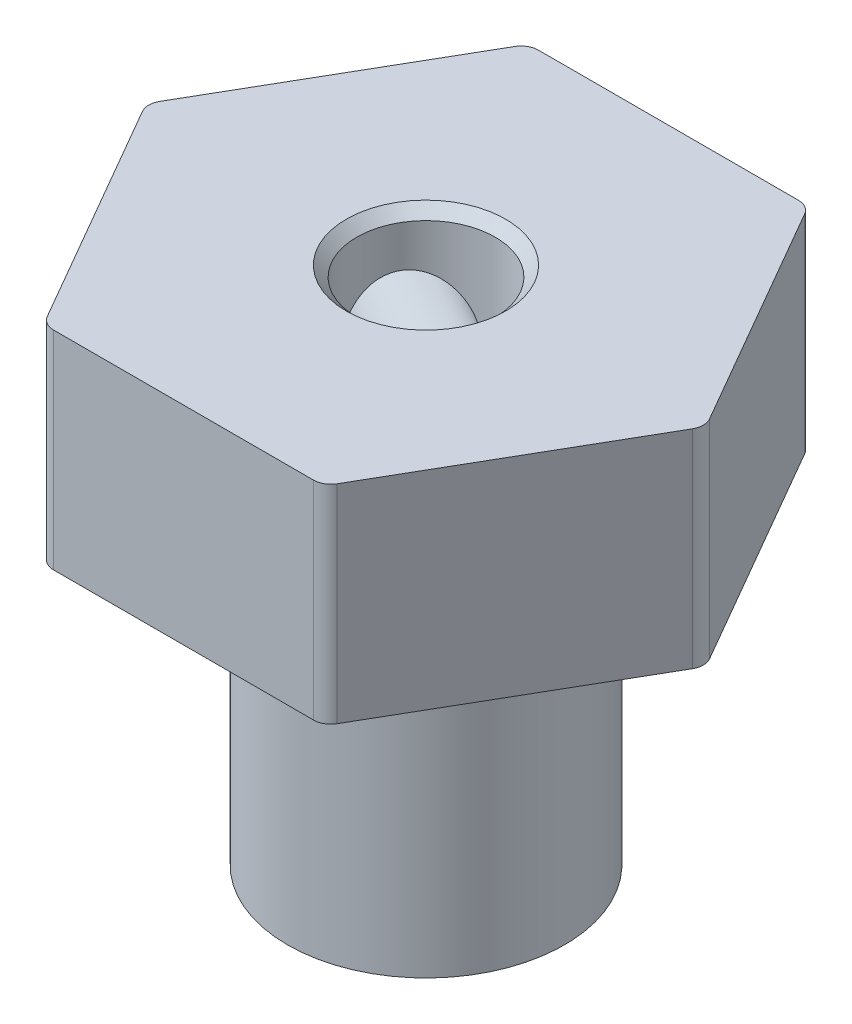
ISO-10303-21;
HEADER;
FILE_DESCRIPTION(('STEP AP214'),'2;1');
FILE_NAME('part.step','',(''),(''),'','','');
FILE_SCHEMA(('AUTOMOTIVE_DESIGN { 1 0 10303 214 1 1 1 1 }'));
ENDSEC;
DATA;
#1=APPLICATION_CONTEXT('core data for automotive mechanical design processes');
#2=APPLICATION_PROTOCOL_DEFINITION('international standard','automotive_design',2000,#1);
#3=PRODUCT_CONTEXT('',#1,'mechanical');
#4=PRODUCT('Part','Part','',(#3));
#5=PRODUCT_RELATED_PRODUCT_CATEGORY('part','',(#4));
#6=PRODUCT_DEFINITION_FORMATION('','',#4);
#7=PRODUCT_DEFINITION_CONTEXT('part definition',#1,'design');
#8=PRODUCT_DEFINITION('design','',#6,#7);
#9=PRODUCT_DEFINITION_SHAPE('','',#8);
#10=(LENGTH_UNIT() NAMED_UNIT(*) SI_UNIT(.MILLI.,.METRE.));
#11=(NAMED_UNIT(*) PLANE_ANGLE_UNIT() SI_UNIT($,.RADIAN.));
#12=(NAMED_UNIT(*) SI_UNIT($,.STERADIAN.) SOLID_ANGLE_UNIT());
#13=UNCERTAINTY_MEASURE_WITH_UNIT(LENGTH_MEASURE(1.E-05),#10,'distance_accuracy_value','');
#14=(GEOMETRIC_REPRESENTATION_CONTEXT(3) GLOBAL_UNCERTAINTY_ASSIGNED_CONTEXT((#13)) GLOBAL_UNIT_ASSIGNED_CONTEXT((#10,
#11,#12)) REPRESENTATION_CONTEXT('',''));
#15=CARTESIAN_POINT('',(0.,0.,0.));
#16=DIRECTION('',(0.,0.,1.));
#17=DIRECTION('',(1.,0.,0.));
#18=AXIS2_PLACEMENT_3D('',#15,#16,#17);
#19=CARTESIAN_POINT('',(4.04145188432745,6.,6.99999999999993));
#20=DIRECTION('',(-0.866025403784441,0.,-0.499999999999995));
#21=DIRECTION('',(-0.499999999999995,0.,0.866025403784441));
#22=AXIS2_PLACEMENT_3D('',#19,#20,#21);
#23=PLANE('',#22);
#24=DIRECTION('',(0.499999999999995,0.,-0.866025403784441));
#25=VECTOR('',#24,1.);
#26=CARTESIAN_POINT('',(4.04145188432745,0.,6.99999999999993));
#27=LINE('',#26,#25);
#28=CARTESIAN_POINT('',(4.18578945162485,0.,6.74999999999993));
#29=VERTEX_POINT('',#28);
#30=CARTESIAN_POINT('',(7.93856620135733,0.,0.249999999999999));
#31=VERTEX_POINT('',#30);
#32=EDGE_CURVE('E272',#29,#31,#27,.T.);
#33=ORIENTED_EDGE('',*,*,#32,.T.);
#34=DIRECTION('',(0.,-1.,0.));
#35=VECTOR('',#34,1.);
#36=CARTESIAN_POINT('',(7.93856620135733,6.,0.249999999999999));
#37=LINE('',#36,#35);
#38=CARTESIAN_POINT('',(7.93856620135733,6.,0.249999999999999));
#39=VERTEX_POINT('',#38);
#40=EDGE_CURVE('E240',#31,#39,#37,.F.);
#41=ORIENTED_EDGE('',*,*,#40,.T.);
#42=DIRECTION('',(0.499999999999995,0.,-0.866025403784441));
#43=VECTOR('',#42,1.);
#44=CARTESIAN_POINT('',(4.04145188432745,6.,6.99999999999993));
#45=LINE('',#44,#43);
#46=CARTESIAN_POINT('',(4.18578945162485,6.,6.74999999999993));
#47=VERTEX_POINT('',#46);
#48=EDGE_CURVE('E167',#47,#39,#45,.T.);
#49=ORIENTED_EDGE('',*,*,#48,.F.);
#50=DIRECTION('',(0.,-1.,0.));
#51=VECTOR('',#50,1.);
#52=CARTESIAN_POINT('',(4.18578945162485,6.,6.74999999999993));
#53=LINE('',#52,#51);
#54=EDGE_CURVE('E236',#47,#29,#53,.T.);
#55=ORIENTED_EDGE('',*,*,#54,.T.);
#56=EDGE_LOOP('',(#33,#41,#49,#55));
#57=FACE_BOUND('',#56,.T.);
#58=ADVANCED_FACE('F40',(#57),#23,.F.);
#59=CARTESIAN_POINT('',(8.08290376865473,6.,0.));
#60=DIRECTION('',(-0.866025403784438,0.,0.500000000000001));
#61=DIRECTION('',(0.500000000000001,0.,0.866025403784438));
#62=AXIS2_PLACEMENT_3D('',#59,#60,#61);
#63=PLANE('',#62);
#64=DIRECTION('',(-0.500000000000001,0.,-0.866025403784438));
#65=VECTOR('',#64,1.);
#66=CARTESIAN_POINT('',(8.08290376865473,0.,0.));
#67=LINE('',#66,#65);
#68=CARTESIAN_POINT('',(7.93856620135733,0.,-0.249999999999999));
#69=VERTEX_POINT('',#68);
#70=CARTESIAN_POINT('',(4.18578945162476,0.,-6.74999999999999));
#71=VERTEX_POINT('',#70);
#72=EDGE_CURVE('E276',#69,#71,#67,.T.);
#73=ORIENTED_EDGE('',*,*,#72,.T.);
#74=DIRECTION('',(0.,-1.,0.));
#75=VECTOR('',#74,1.);
#76=CARTESIAN_POINT('',(4.18578945162476,6.,-6.74999999999998));
#77=LINE('',#76,#75);
#78=CARTESIAN_POINT('',(4.18578945162476,6.,-6.74999999999999));
#79=VERTEX_POINT('',#78);
#80=EDGE_CURVE('E233',#71,#79,#77,.F.);
#81=ORIENTED_EDGE('',*,*,#80,.T.);
#82=DIRECTION('',(-0.500000000000001,0.,-0.866025403784438));
#83=VECTOR('',#82,1.);
#84=CARTESIAN_POINT('',(8.08290376865473,6.,0.));
#85=LINE('',#84,#83);
#86=CARTESIAN_POINT('',(7.93856620135733,6.,-0.249999999999999));
#87=VERTEX_POINT('',#86);
#88=EDGE_CURVE('E173',#87,#79,#85,.T.);
#89=ORIENTED_EDGE('',*,*,#88,.F.);
#90=DIRECTION('',(0.,-1.,0.));
#91=VECTOR('',#90,1.);
#92=CARTESIAN_POINT('',(7.93856620135733,6.,-0.249999999999999));
#93=LINE('',#92,#91);
#94=EDGE_CURVE('E229',#87,#69,#93,.T.);
#95=ORIENTED_EDGE('',*,*,#94,.T.);
#96=EDGE_LOOP('',(#73,#81,#89,#95));
#97=FACE_BOUND('',#96,.T.);
#98=ADVANCED_FACE('F306',(#97),#63,.F.);
#99=CARTESIAN_POINT('',(4.04145188432735,6.,-6.99999999999998));
#100=DIRECTION('',(0.,0.,1.));
#101=DIRECTION('',(1.,0.,0.));
#102=AXIS2_PLACEMENT_3D('',#99,#100,#101);
#103=PLANE('',#102);
#104=DIRECTION('',(-1.,0.,0.));
#105=VECTOR('',#104,1.);
#106=CARTESIAN_POINT('',(4.04145188432735,0.,-6.99999999999998));
#107=LINE('',#106,#105);
#108=CARTESIAN_POINT('',(3.75277674973254,0.,-6.99999999999998));
#109=VERTEX_POINT('',#108);
#110=CARTESIAN_POINT('',(-3.75277674973258,0.,-6.99999999999996));
#111=VERTEX_POINT('',#110);
#112=EDGE_CURVE('E280',#109,#111,#107,.T.);
#113=ORIENTED_EDGE('',*,*,#112,.T.);
#114=DIRECTION('',(0.,-1.,0.));
#115=VECTOR('',#114,1.);
#116=CARTESIAN_POINT('',(-3.75277674973258,6.,-6.99999999999996));
#117=LINE('',#116,#115);
#118=CARTESIAN_POINT('',(-3.75277674973258,6.,-6.99999999999996));
#119=VERTEX_POINT('',#118);
#120=EDGE_CURVE('E226',#111,#119,#117,.F.);
#121=ORIENTED_EDGE('',*,*,#120,.T.);
#122=DIRECTION('',(-1.,0.,0.));
#123=VECTOR('',#122,1.);
#124=CARTESIAN_POINT('',(4.04145188432735,6.,-6.99999999999998));
#125=LINE('',#124,#123);
#126=CARTESIAN_POINT('',(3.75277674973254,6.,-6.99999999999998));
#127=VERTEX_POINT('',#126);
#128=EDGE_CURVE('E260',#127,#119,#125,.T.);
#129=ORIENTED_EDGE('',*,*,#128,.F.);
#130=DIRECTION('',(0.,-1.,0.));
#131=VECTOR('',#130,1.);
#132=CARTESIAN_POINT('',(3.75277674973254,6.,-6.99999999999998));
#133=LINE('',#132,#131);
#134=EDGE_CURVE('E222',#127,#109,#133,.T.);
#135=ORIENTED_EDGE('',*,*,#134,.T.);
#136=EDGE_LOOP('',(#113,#121,#129,#135));
#137=FACE_BOUND('',#136,.T.);
#138=ADVANCED_FACE('F302',(#137),#103,.F.);
#139=CARTESIAN_POINT('',(-4.0414518843274,6.,-6.99999999999995));
#140=DIRECTION('',(0.866025403784441,0.,0.499999999999995));
#141=DIRECTION('',(0.499999999999995,0.,-0.866025403784441));
#142=AXIS2_PLACEMENT_3D('',#139,#140,#141);
#143=PLANE('',#142);
#144=CARTESIAN_POINT('',(-6.06217782649107,3.,-3.49999999999995));
#145=DIRECTION('',(-0.866025403784442,0.,-0.499999999999995));
#146=DIRECTION('',(-0.499999999999995,0.,0.866025403784442));
#147=AXIS2_PLACEMENT_3D('',#144,#145,#146);
#148=CIRCLE('',#147,1.5);
#149=CARTESIAN_POINT('',(-6.81217782649106,3.,-2.20096189432329));
#150=VERTEX_POINT('',#149);
#151=EDGE_CURVE('E422',#150,#150,#148,.T.);
#152=ORIENTED_EDGE('',*,*,#151,.F.);
#153=EDGE_LOOP('',(#152));
#154=FACE_BOUND('',#153,.T.);
#155=DIRECTION('',(-0.499999999999995,0.,0.866025403784441));
#156=VECTOR('',#155,1.);
#157=CARTESIAN_POINT('',(-4.0414518843274,0.,-6.99999999999995));
#158=LINE('',#157,#156);
#159=CARTESIAN_POINT('',(-4.1857894516248,0.,-6.74999999999995));
#160=VERTEX_POINT('',#159);
#161=CARTESIAN_POINT('',(-7.93856620135733,0.,-0.249999999999944));
#162=VERTEX_POINT('',#161);
#163=EDGE_CURVE('E175',#160,#162,#158,.T.);
#164=ORIENTED_EDGE('',*,*,#163,.T.);
#165=DIRECTION('',(0.,-1.,0.));
#166=VECTOR('',#165,1.);
#167=CARTESIAN_POINT('',(-7.93856620135733,6.,-0.249999999999945));
#168=LINE('',#167,#166);
#169=CARTESIAN_POINT('',(-7.93856620135733,6.,-0.249999999999944));
#170=VERTEX_POINT('',#169);
#171=EDGE_CURVE('E62',#162,#170,#168,.F.);
#172=ORIENTED_EDGE('',*,*,#171,.T.);
#173=DIRECTION('',(-0.499999999999995,0.,0.866025403784441));
#174=VECTOR('',#173,1.);
#175=CARTESIAN_POINT('',(-4.0414518843274,6.,-6.99999999999995));
#176=LINE('',#175,#174);
#177=CARTESIAN_POINT('',(-4.1857894516248,6.,-6.74999999999995));
#178=VERTEX_POINT('',#177);
#179=EDGE_CURVE('E263',#178,#170,#176,.T.);
#180=ORIENTED_EDGE('',*,*,#179,.F.);
#181=DIRECTION('',(0.,-1.,0.));
#182=VECTOR('',#181,1.);
#183=CARTESIAN_POINT('',(-4.1857894516248,6.,-6.74999999999995));
#184=LINE('',#183,#182);
#185=EDGE_CURVE('E216',#178,#160,#184,.T.);
#186=ORIENTED_EDGE('',*,*,#185,.T.);
#187=EDGE_LOOP('',(#164,#172,#180,#186));
#188=FACE_BOUND('',#187,.T.);
#189=ADVANCED_FACE('F285',(#154,#188),#143,.F.);
#190=CARTESIAN_POINT('',(-8.08290376865473,6.,0.));
#191=DIRECTION('',(0.866025403784434,0.,-0.500000000000007));
#192=DIRECTION('',(-0.500000000000007,0.,-0.866025403784435));
#193=AXIS2_PLACEMENT_3D('',#190,#191,#192);
#194=PLANE('',#193);
#195=DIRECTION('',(0.500000000000007,0.,0.866025403784435));
#196=VECTOR('',#195,1.);
#197=CARTESIAN_POINT('',(-8.08290376865473,0.,0.));
#198=LINE('',#197,#196);
#199=CARTESIAN_POINT('',(-7.93856620135732,0.,0.250000000000056));
#200=VERTEX_POINT('',#199);
#201=CARTESIAN_POINT('',(-4.18578945162471,0.,6.75000000000002));
#202=VERTEX_POINT('',#201);
#203=EDGE_CURVE('E168',#200,#202,#198,.T.);
#204=ORIENTED_EDGE('',*,*,#203,.T.);
#205=DIRECTION('',(0.,-1.,0.));
#206=VECTOR('',#205,1.);
#207=CARTESIAN_POINT('',(-4.18578945162471,6.,6.75000000000001));
#208=LINE('',#207,#206);
#209=CARTESIAN_POINT('',(-4.18578945162471,6.,6.75000000000002));
#210=VERTEX_POINT('',#209);
#211=EDGE_CURVE('E143',#202,#210,#208,.F.);
#212=ORIENTED_EDGE('',*,*,#211,.T.);
#213=DIRECTION('',(0.500000000000007,0.,0.866025403784435));
#214=VECTOR('',#213,1.);
#215=CARTESIAN_POINT('',(-8.08290376865473,6.,0.));
#216=LINE('',#215,#214);
#217=CARTESIAN_POINT('',(-7.93856620135732,6.,0.250000000000056));
#218=VERTEX_POINT('',#217);
#219=EDGE_CURVE('E266',#218,#210,#216,.T.);
#220=ORIENTED_EDGE('',*,*,#219,.F.);
#221=DIRECTION('',(0.,-1.,0.));
#222=VECTOR('',#221,1.);
#223=CARTESIAN_POINT('',(-7.93856620135732,6.,0.250000000000056));
#224=LINE('',#223,#222);
#225=EDGE_CURVE('E149',#218,#200,#224,.T.);
#226=ORIENTED_EDGE('',*,*,#225,.T.);
#227=EDGE_LOOP('',(#204,#212,#220,#226));
#228=FACE_BOUND('',#227,.T.);
#229=ADVANCED_FACE('F294',(#228),#194,.F.);
#230=CARTESIAN_POINT('',(-4.0414518843273,6.,7.00000000000001));
#231=DIRECTION('',(0.,0.,-1.));
#232=DIRECTION('',(-1.,0.,0.));
#233=AXIS2_PLACEMENT_3D('',#230,#231,#232);
#234=PLANE('',#233);
#235=DIRECTION('',(1.,0.,0.));
#236=VECTOR('',#235,1.);
#237=CARTESIAN_POINT('',(-4.0414518843273,6.,7.00000000000001));
#238=LINE('',#237,#236);
#239=CARTESIAN_POINT('',(-3.75277674973249,6.,7.00000000000001));
#240=VERTEX_POINT('',#239);
#241=CARTESIAN_POINT('',(3.75277674973264,6.,6.99999999999993));
#242=VERTEX_POINT('',#241);
#243=EDGE_CURVE('E159',#240,#242,#238,.T.);
#244=ORIENTED_EDGE('',*,*,#243,.F.);
#245=DIRECTION('',(0.,-1.,0.));
#246=VECTOR('',#245,1.);
#247=CARTESIAN_POINT('',(-3.75277674973249,6.,7.00000000000001));
#248=LINE('',#247,#246);
#249=CARTESIAN_POINT('',(-3.75277674973249,0.,7.00000000000001));
#250=VERTEX_POINT('',#249);
#251=EDGE_CURVE('E142',#240,#250,#248,.T.);
#252=ORIENTED_EDGE('',*,*,#251,.T.);
#253=DIRECTION('',(1.,0.,0.));
#254=VECTOR('',#253,1.);
#255=CARTESIAN_POINT('',(-4.0414518843273,0.,7.00000000000001));
#256=LINE('',#255,#254);
#257=CARTESIAN_POINT('',(3.75277674973264,0.,6.99999999999993));
#258=VERTEX_POINT('',#257);
#259=EDGE_CURVE('E156',#250,#258,#256,.T.);
#260=ORIENTED_EDGE('',*,*,#259,.T.);
#261=DIRECTION('',(0.,-1.,0.));
#262=VECTOR('',#261,1.);
#263=CARTESIAN_POINT('',(3.75277674973264,6.,6.99999999999993));
#264=LINE('',#263,#262);
#265=EDGE_CURVE('E162',#258,#242,#264,.F.);
#266=ORIENTED_EDGE('',*,*,#265,.T.);
#267=EDGE_LOOP('',(#244,#252,#260,#266));
#268=FACE_BOUND('',#267,.T.);
#269=ADVANCED_FACE('F155',(#268),#234,.F.);
#270=CARTESIAN_POINT('',(0.,6.,0.));
#271=DIRECTION('',(0.,1.,0.));
#272=DIRECTION('',(0.,0.,1.));
#273=AXIS2_PLACEMENT_3D('',#270,#271,#272);
#274=PLANE('',#273);
#275=CARTESIAN_POINT('',(0.,6.,0.));
#276=DIRECTION('',(0.,1.,0.));
#277=DIRECTION('',(0.,0.,1.));
#278=AXIS2_PLACEMENT_3D('',#275,#276,#277);
#279=CIRCLE('',#278,2.3);
#280=CARTESIAN_POINT('',(0.,6.,2.3));
#281=VERTEX_POINT('',#280);
#282=EDGE_CURVE('E11',#281,#281,#279,.F.);
#283=ORIENTED_EDGE('',*,*,#282,.T.);
#284=EDGE_LOOP('',(#283));
#285=FACE_BOUND('',#284,.T.);
#286=ORIENTED_EDGE('',*,*,#219,.T.);
#287=CARTESIAN_POINT('',(-3.75277674973249,6.,6.50000000000001));
#288=DIRECTION('',(0.,1.,0.));
#289=DIRECTION('',(0.,0.,1.));
#290=AXIS2_PLACEMENT_3D('',#287,#288,#289);
#291=CIRCLE('',#290,0.5);
#292=EDGE_CURVE('E213',#210,#240,#291,.T.);
#293=ORIENTED_EDGE('',*,*,#292,.T.);
#294=ORIENTED_EDGE('',*,*,#243,.T.);
#295=CARTESIAN_POINT('',(3.75277674973263,6.,6.49999999999993));
#296=DIRECTION('',(0.,1.,0.));
#297=DIRECTION('',(0.,0.,1.));
#298=AXIS2_PLACEMENT_3D('',#295,#296,#297);
#299=CIRCLE('',#298,0.5);
#300=EDGE_CURVE('E199',#242,#47,#299,.T.);
#301=ORIENTED_EDGE('',*,*,#300,.T.);
#302=ORIENTED_EDGE('',*,*,#48,.T.);
#303=CARTESIAN_POINT('',(7.50555349946511,6.,0.));
#304=DIRECTION('',(0.,1.,0.));
#305=DIRECTION('',(0.,0.,1.));
#306=AXIS2_PLACEMENT_3D('',#303,#304,#305);
#307=CIRCLE('',#306,0.5);
#308=EDGE_CURVE('E202',#39,#87,#307,.T.);
#309=ORIENTED_EDGE('',*,*,#308,.T.);
#310=ORIENTED_EDGE('',*,*,#88,.T.);
#311=CARTESIAN_POINT('',(3.75277674973254,6.,-6.49999999999998));
#312=DIRECTION('',(0.,1.,0.));
#313=DIRECTION('',(0.,0.,1.));
#314=AXIS2_PLACEMENT_3D('',#311,#312,#313);
#315=CIRCLE('',#314,0.5);
#316=EDGE_CURVE('E205',#79,#127,#315,.T.);
#317=ORIENTED_EDGE('',*,*,#316,.T.);
#318=ORIENTED_EDGE('',*,*,#128,.T.);
#319=CARTESIAN_POINT('',(-3.75277674973258,6.,-6.49999999999996));
#320=DIRECTION('',(0.,1.,0.));
#321=DIRECTION('',(0.,0.,1.));
#322=AXIS2_PLACEMENT_3D('',#319,#320,#321);
#323=CIRCLE('',#322,0.5);
#324=EDGE_CURVE('E69',#119,#178,#323,.T.);
#325=ORIENTED_EDGE('',*,*,#324,.T.);
#326=ORIENTED_EDGE('',*,*,#179,.T.);
#327=CARTESIAN_POINT('',(-7.50555349946511,6.,0.));
#328=DIRECTION('',(0.,1.,0.));
#329=DIRECTION('',(0.,0.,1.));
#330=AXIS2_PLACEMENT_3D('',#327,#328,#329);
#331=CIRCLE('',#330,0.5);
#332=EDGE_CURVE('E210',#170,#218,#331,.T.);
#333=ORIENTED_EDGE('',*,*,#332,.T.);
#334=EDGE_LOOP('',(#286,#293,#294,#301,#302,#309,#310,#317,#318,#325,#326,#333));
#335=FACE_BOUND('',#334,.T.);
#336=ADVANCED_FACE('F292',(#285,#335),#274,.T.);
#337=CARTESIAN_POINT('',(0.,0.,0.));
#338=DIRECTION('',(0.,1.,0.));
#339=DIRECTION('',(0.,0.,1.));
#340=AXIS2_PLACEMENT_3D('',#337,#338,#339);
#341=PLANE('',#340);
#342=CARTESIAN_POINT('',(0.,0.,0.));
#343=DIRECTION('',(0.,-1.,0.));
#344=DIRECTION('',(0.,0.,-1.));
#345=AXIS2_PLACEMENT_3D('',#342,#343,#344);
#346=CIRCLE('',#345,4.);
#347=CARTESIAN_POINT('',(0.,0.,-4.));
#348=VERTEX_POINT('',#347);
#349=EDGE_CURVE('E243',#348,#348,#346,.T.);
#350=ORIENTED_EDGE('',*,*,#349,.F.);
#351=EDGE_LOOP('',(#350));
#352=FACE_BOUND('',#351,.T.);
#353=ORIENTED_EDGE('',*,*,#259,.F.);
#354=CARTESIAN_POINT('',(-3.75277674973249,0.,6.50000000000001));
#355=DIRECTION('',(0.,1.,0.));
#356=DIRECTION('',(0.,0.,1.));
#357=AXIS2_PLACEMENT_3D('',#354,#355,#356);
#358=CIRCLE('',#357,0.5);
#359=EDGE_CURVE('E138',#250,#202,#358,.F.);
#360=ORIENTED_EDGE('',*,*,#359,.T.);
#361=ORIENTED_EDGE('',*,*,#203,.F.);
#362=CARTESIAN_POINT('',(-7.50555349946511,0.,0.));
#363=DIRECTION('',(0.,1.,0.));
#364=DIRECTION('',(0.,0.,1.));
#365=AXIS2_PLACEMENT_3D('',#362,#363,#364);
#366=CIRCLE('',#365,0.5);
#367=EDGE_CURVE('E150',#200,#162,#366,.F.);
#368=ORIENTED_EDGE('',*,*,#367,.T.);
#369=ORIENTED_EDGE('',*,*,#163,.F.);
#370=CARTESIAN_POINT('',(-3.75277674973258,0.,-6.49999999999996));
#371=DIRECTION('',(0.,1.,0.));
#372=DIRECTION('',(0.,0.,1.));
#373=AXIS2_PLACEMENT_3D('',#370,#371,#372);
#374=CIRCLE('',#373,0.5);
#375=EDGE_CURVE('E189',#160,#111,#374,.F.);
#376=ORIENTED_EDGE('',*,*,#375,.T.);
#377=ORIENTED_EDGE('',*,*,#112,.F.);
#378=CARTESIAN_POINT('',(3.75277674973254,0.,-6.49999999999998));
#379=DIRECTION('',(0.,1.,0.));
#380=DIRECTION('',(0.,0.,1.));
#381=AXIS2_PLACEMENT_3D('',#378,#379,#380);
#382=CIRCLE('',#381,0.5);
#383=EDGE_CURVE('E186',#109,#71,#382,.F.);
#384=ORIENTED_EDGE('',*,*,#383,.T.);
#385=ORIENTED_EDGE('',*,*,#72,.F.);
#386=CARTESIAN_POINT('',(7.50555349946511,0.,0.));
#387=DIRECTION('',(0.,1.,0.));
#388=DIRECTION('',(0.,0.,1.));
#389=AXIS2_PLACEMENT_3D('',#386,#387,#388);
#390=CIRCLE('',#389,0.5);
#391=EDGE_CURVE('E183',#69,#31,#390,.F.);
#392=ORIENTED_EDGE('',*,*,#391,.T.);
#393=ORIENTED_EDGE('',*,*,#32,.F.);
#394=CARTESIAN_POINT('',(3.75277674973263,0.,6.49999999999993));
#395=DIRECTION('',(0.,1.,0.));
#396=DIRECTION('',(0.,0.,1.));
#397=AXIS2_PLACEMENT_3D('',#394,#395,#396);
#398=CIRCLE('',#397,0.5);
#399=EDGE_CURVE('E161',#29,#258,#398,.F.);
#400=ORIENTED_EDGE('',*,*,#399,.T.);
#401=EDGE_LOOP('',(#353,#360,#361,#368,#369,#376,#377,#384,#385,#392,#393,#400));
#402=FACE_BOUND('',#401,.T.);
#403=ADVANCED_FACE('F164',(#352,#402),#341,.F.);
#404=CARTESIAN_POINT('',(-3.75277674973249,6.,6.50000000000001));
#405=DIRECTION('',(0.,-1.,0.));
#406=DIRECTION('',(0.,0.,-1.));
#407=AXIS2_PLACEMENT_3D('',#404,#405,#406);
#408=CYLINDRICAL_SURFACE('',#407,0.5);
#409=ORIENTED_EDGE('',*,*,#292,.F.);
#410=ORIENTED_EDGE('',*,*,#211,.F.);
#411=ORIENTED_EDGE('',*,*,#359,.F.);
#412=ORIENTED_EDGE('',*,*,#251,.F.);
#413=EDGE_LOOP('',(#409,#410,#411,#412));
#414=FACE_BOUND('',#413,.T.);
#415=ADVANCED_FACE('F141',(#414),#408,.T.);
#416=CARTESIAN_POINT('',(-7.50555349946511,6.,0.));
#417=DIRECTION('',(0.,-1.,0.));
#418=DIRECTION('',(0.,0.,-1.));
#419=AXIS2_PLACEMENT_3D('',#416,#417,#418);
#420=CYLINDRICAL_SURFACE('',#419,0.5);
#421=ORIENTED_EDGE('',*,*,#332,.F.);
#422=ORIENTED_EDGE('',*,*,#171,.F.);
#423=ORIENTED_EDGE('',*,*,#367,.F.);
#424=ORIENTED_EDGE('',*,*,#225,.F.);
#425=EDGE_LOOP('',(#421,#422,#423,#424));
#426=FACE_BOUND('',#425,.T.);
#427=ADVANCED_FACE('F289',(#426),#420,.T.);
#428=CARTESIAN_POINT('',(-3.75277674973258,6.,-6.49999999999996));
#429=DIRECTION('',(0.,-1.,0.));
#430=DIRECTION('',(0.,0.,-1.));
#431=AXIS2_PLACEMENT_3D('',#428,#429,#430);
#432=CYLINDRICAL_SURFACE('',#431,0.5);
#433=ORIENTED_EDGE('',*,*,#324,.F.);
#434=ORIENTED_EDGE('',*,*,#120,.F.);
#435=ORIENTED_EDGE('',*,*,#375,.F.);
#436=ORIENTED_EDGE('',*,*,#185,.F.);
#437=EDGE_LOOP('',(#433,#434,#435,#436));
#438=FACE_BOUND('',#437,.T.);
#439=ADVANCED_FACE('F320',(#438),#432,.T.);
#440=CARTESIAN_POINT('',(3.75277674973254,6.,-6.49999999999998));
#441=DIRECTION('',(0.,-1.,0.));
#442=DIRECTION('',(0.,0.,-1.));
#443=AXIS2_PLACEMENT_3D('',#440,#441,#442);
#444=CYLINDRICAL_SURFACE('',#443,0.5);
#445=ORIENTED_EDGE('',*,*,#316,.F.);
#446=ORIENTED_EDGE('',*,*,#80,.F.);
#447=ORIENTED_EDGE('',*,*,#383,.F.);
#448=ORIENTED_EDGE('',*,*,#134,.F.);
#449=EDGE_LOOP('',(#445,#446,#447,#448));
#450=FACE_BOUND('',#449,.T.);
#451=ADVANCED_FACE('F323',(#450),#444,.T.);
#452=CARTESIAN_POINT('',(7.50555349946511,6.,0.));
#453=DIRECTION('',(0.,-1.,0.));
#454=DIRECTION('',(0.,0.,-1.));
#455=AXIS2_PLACEMENT_3D('',#452,#453,#454);
#456=CYLINDRICAL_SURFACE('',#455,0.5);
#457=ORIENTED_EDGE('',*,*,#308,.F.);
#458=ORIENTED_EDGE('',*,*,#40,.F.);
#459=ORIENTED_EDGE('',*,*,#391,.F.);
#460=ORIENTED_EDGE('',*,*,#94,.F.);
#461=EDGE_LOOP('',(#457,#458,#459,#460));
#462=FACE_BOUND('',#461,.T.);
#463=ADVANCED_FACE('F327',(#462),#456,.T.);
#464=CARTESIAN_POINT('',(3.75277674973263,6.,6.49999999999993));
#465=DIRECTION('',(0.,-1.,0.));
#466=DIRECTION('',(0.,0.,-1.));
#467=AXIS2_PLACEMENT_3D('',#464,#465,#466);
#468=CYLINDRICAL_SURFACE('',#467,0.5);
#469=ORIENTED_EDGE('',*,*,#300,.F.);
#470=ORIENTED_EDGE('',*,*,#265,.F.);
#471=ORIENTED_EDGE('',*,*,#399,.F.);
#472=ORIENTED_EDGE('',*,*,#54,.F.);
#473=EDGE_LOOP('',(#469,#470,#471,#472));
#474=FACE_BOUND('',#473,.T.);
#475=ADVANCED_FACE('F330',(#474),#468,.T.);
#476=CARTESIAN_POINT('',(0.,-9.,0.));
#477=DIRECTION('',(0.,1.,0.));
#478=DIRECTION('',(0.,0.,1.));
#479=AXIS2_PLACEMENT_3D('',#476,#477,#478);
#480=CYLINDRICAL_SURFACE('',#479,4.);
#481=CARTESIAN_POINT('',(0.,-9.,0.));
#482=DIRECTION('',(0.,-1.,0.));
#483=DIRECTION('',(0.,0.,-1.));
#484=AXIS2_PLACEMENT_3D('',#481,#482,#483);
#485=CIRCLE('',#484,4.);
#486=CARTESIAN_POINT('',(0.,-9.,-4.));
#487=VERTEX_POINT('',#486);
#488=EDGE_CURVE('E254',#487,#487,#485,.T.);
#489=ORIENTED_EDGE('',*,*,#488,.F.);
#490=EDGE_LOOP('',(#489));
#491=FACE_BOUND('',#490,.T.);
#492=ORIENTED_EDGE('',*,*,#349,.T.);
#493=EDGE_LOOP('',(#492));
#494=FACE_BOUND('',#493,.T.);
#495=ADVANCED_FACE('F333',(#491,#494),#480,.T.);
#496=CARTESIAN_POINT('',(0.,-9.,0.));
#497=DIRECTION('',(0.,-1.,0.));
#498=DIRECTION('',(0.,0.,-1.));
#499=AXIS2_PLACEMENT_3D('',#496,#497,#498);
#500=PLANE('',#499);
#501=CARTESIAN_POINT('',(0.,-9.,0.));
#502=DIRECTION('',(0.,1.,0.));
#503=DIRECTION('',(0.,0.,1.));
#504=AXIS2_PLACEMENT_3D('',#501,#502,#503);
#505=CIRCLE('',#504,2.);
#506=CARTESIAN_POINT('',(0.,-9.,2.));
#507=VERTEX_POINT('',#506);
#508=EDGE_CURVE('E415',#507,#507,#505,.T.);
#509=ORIENTED_EDGE('',*,*,#508,.T.);
#510=EDGE_LOOP('',(#509));
#511=FACE_BOUND('',#510,.T.);
#512=ORIENTED_EDGE('',*,*,#488,.T.);
#513=EDGE_LOOP('',(#512));
#514=FACE_BOUND('',#513,.T.);
#515=ADVANCED_FACE('F338',(#511,#514),#500,.T.);
#516=CARTESIAN_POINT('',(0.,-9.,0.));
#517=DIRECTION('',(0.,1.,0.));
#518=DIRECTION('',(0.,0.,1.));
#519=AXIS2_PLACEMENT_3D('',#516,#517,#518);
#520=CYLINDRICAL_SURFACE('',#519,2.);
#521=CARTESIAN_POINT('',(-1.89564392373896,3.,0.637600277910524));
#522=CARTESIAN_POINT('',(-1.89565408748977,3.06999742342563,0.63758539222602));
#523=CARTESIAN_POINT('',(-1.89809043080659,3.14004583431192,0.630461731209006));
#524=CARTESIAN_POINT('',(-1.90694493610832,3.27732985620948,0.603112635919795));
#525=CARTESIAN_POINT('',(-1.91337496438087,3.34455644501951,0.582848148864566));
#526=CARTESIAN_POINT('',(-1.92810346331423,3.47357984673838,0.532070602372366));
#527=CARTESIAN_POINT('',(-1.9363749313233,3.53543877676246,0.501702798658396));
#528=CARTESIAN_POINT('',(-1.9529234442087,3.65434545444519,0.432833528036548));
#529=CARTESIAN_POINT('',(-1.96120048829051,3.71139378246922,0.394333044249432));
#530=CARTESIAN_POINT('',(-1.97773475424673,3.83211279631659,0.301990819027161));
#531=CARTESIAN_POINT('',(-1.98562473025925,3.89466793422648,0.246624837378536));
#532=CARTESIAN_POINT('',(-1.99678356754875,4.01252546624227,0.128107308785519));
#533=CARTESIAN_POINT('',(-2.000045557029,4.06781696482027,0.0649443354291084));
#534=CARTESIAN_POINT('',(-1.99994409142852,4.18085873865547,-0.0812468700736267));
#535=CARTESIAN_POINT('',(-1.99509185976308,4.23680596671986,-0.165697957718432));
#536=CARTESIAN_POINT('',(-1.97270771920409,4.33462220828284,-0.340826196887825));
#537=CARTESIAN_POINT('',(-1.95520591099417,4.37652429746881,-0.431488106501223));
#538=CARTESIAN_POINT('',(-1.91298074093011,4.43320768590294,-0.587305342613249));
#539=CARTESIAN_POINT('',(-1.89202742708328,4.45235709597847,-0.651906585398062));
#540=CARTESIAN_POINT('',(-1.84275156522514,4.48139011599675,-0.780373382054082));
#541=CARTESIAN_POINT('',(-1.81443544704665,4.49128177610674,-0.84423952730852));
#542=CARTESIAN_POINT('',(-1.75077468959898,4.50122173386249,-0.969396796570664));
#543=CARTESIAN_POINT('',(-1.71541202495333,4.50124445437644,-1.03068081801613));
#544=CARTESIAN_POINT('',(-1.63879999349243,4.49138206321971,-1.14859927788889));
#545=CARTESIAN_POINT('',(-1.59754926533105,4.48149465709186,-1.20523263627904));
#546=CARTESIAN_POINT('',(-1.51222065234838,4.45291894941013,-1.31058455676589));
#547=CARTESIAN_POINT('',(-1.4682879852632,4.43454367361293,-1.35950776469479));
#548=CARTESIAN_POINT('',(-1.37790903600702,4.39000435781776,-1.45103711456793));
#549=CARTESIAN_POINT('',(-1.33146220755323,4.36383861948684,-1.49364187604387));
#550=CARTESIAN_POINT('',(-1.23239733682158,4.30147038485469,-1.57664611720255));
#551=CARTESIAN_POINT('',(-1.17965563227528,4.26448790338124,-1.61630732162638));
#552=CARTESIAN_POINT('',(-1.07457113996937,4.18326629602949,-1.68800223890063));
#553=CARTESIAN_POINT('',(-1.02222873227807,4.1390209863001,-1.72002939434675));
#554=CARTESIAN_POINT('',(-0.909461642408371,4.03477665117906,-1.78264154526087));
#555=CARTESIAN_POINT('',(-0.849472575511647,3.9733907899736,-1.81170345690481));
#556=CARTESIAN_POINT('',(-0.735282235280919,3.84216541637806,-1.86097297626604));
#557=CARTESIAN_POINT('',(-0.681083725991976,3.77232190047494,-1.88117636964407));
#558=CARTESIAN_POINT('',(-0.592127494785224,3.63901812975437,-1.91079361445672));
#559=CARTESIAN_POINT('',(-0.555643511488166,3.57701295469935,-1.92154920300619));
#560=CARTESIAN_POINT('',(-0.491826641358087,3.44793471858062,-1.93886609379974));
#561=CARTESIAN_POINT('',(-0.464473103722224,3.38087352030963,-1.94543689201414));
#562=CARTESIAN_POINT('',(-0.426505115286103,3.25631305600168,-1.95407248304111));
#563=CARTESIAN_POINT('',(-0.413647540168987,3.19955291788314,-1.95677223513885));
#564=CARTESIAN_POINT('',(-0.397567036428447,3.08464453382617,-1.96010546225804));
#565=CARTESIAN_POINT('',(-0.394331781273288,3.02649816009718,-1.96074158096169));
#566=CARTESIAN_POINT('',(-0.39793574372961,2.9105210082666,-1.96001244952257));
#567=CARTESIAN_POINT('',(-0.404778669514209,2.85269035419033,-1.95864646272456));
#568=CARTESIAN_POINT('',(-0.427607342520077,2.73892384755713,-1.95378673256666));
#569=CARTESIAN_POINT('',(-0.443608694536482,2.6829914020519,-1.95028935693044));
#570=CARTESIAN_POINT('',(-0.490410008887606,2.55366195506113,-1.93914011382242));
#571=CARTESIAN_POINT('',(-0.524507283729588,2.48156404608497,-1.93042320958673));
#572=CARTESIAN_POINT('',(-0.602270967960619,2.34369233635988,-1.90759330516805));
#573=CARTESIAN_POINT('',(-0.645954964609422,2.27793048270525,-1.89347035143974));
#574=CARTESIAN_POINT('',(-0.741248766239049,2.15065099195188,-1.85828512333923));
#575=CARTESIAN_POINT('',(-0.793085005232827,2.08936712378174,-1.83699415313664));
#576=CARTESIAN_POINT('',(-0.900859102345454,1.97399790363875,-1.78661638972402));
#577=CARTESIAN_POINT('',(-0.956798945733182,1.91991607201106,-1.7575258048551));
#578=CARTESIAN_POINT('',(-1.08306347963633,1.80872300837063,-1.68328347791819));
#579=CARTESIAN_POINT('',(-1.1538640186322,1.7535247611424,-1.63601237801057));
#580=CARTESIAN_POINT('',(-1.29427595520157,1.65737926654913,-1.52731038197266));
#581=CARTESIAN_POINT('',(-1.36388961107558,1.61640117541871,-1.46591061874742));
#582=CARTESIAN_POINT('',(-1.47700387262091,1.56156200855313,-1.35014237769218));
#583=CARTESIAN_POINT('',(-1.52200059949122,1.54324320672456,-1.29932719312372));
#584=CARTESIAN_POINT('',(-1.60756517285095,1.51587120369248,-1.19182075592637));
#585=CARTESIAN_POINT('',(-1.64813694997,1.50680971845149,-1.13513480695956));
#586=CARTESIAN_POINT('',(-1.72346052121869,1.4984836090714,-1.01715014675134));
#587=CARTESIAN_POINT('',(-1.75819846011136,1.49924198265175,-0.955840941675908));
#588=CARTESIAN_POINT('',(-1.8207033481814,1.51056099130124,-0.830625360315246));
#589=CARTESIAN_POINT('',(-1.84846843777298,1.52112423770748,-0.766718296476742));
#590=CARTESIAN_POINT('',(-1.89593226272871,1.55097491616724,-0.640217011748742));
#591=CARTESIAN_POINT('',(-1.91584176676155,1.57000018132155,-0.577638536564036));
#592=CARTESIAN_POINT('',(-1.94894647050619,1.61578806561894,-0.453580103353952));
#593=CARTESIAN_POINT('',(-1.96214023231773,1.64255233983091,-0.392100383298408));
#594=CARTESIAN_POINT('',(-1.98357363241056,1.70627793759597,-0.264702532323765));
#595=CARTESIAN_POINT('',(-1.99108276584025,1.74405093135959,-0.199070541641531));
#596=CARTESIAN_POINT('',(-1.9997147986867,1.82686644055421,-0.0721024895415927));
#597=CARTESIAN_POINT('',(-2.00083179391228,1.87191563728605,-0.0107704514578858));
#598=CARTESIAN_POINT('',(-1.99774537198575,1.97800536656079,0.118069424022806));
#599=CARTESIAN_POINT('',(-1.99244573883613,2.04044639943991,0.184398800894359));
#600=CARTESIAN_POINT('',(-1.97721613716281,2.17386807189988,0.307317157844431));
#601=CARTESIAN_POINT('',(-1.96728447604931,2.24485182603657,0.363902567021102));
#602=CARTESIAN_POINT('',(-1.948306507184,2.37888325059031,0.453573830174076));
#603=CARTESIAN_POINT('',(-1.93953208214806,2.44033498270656,0.489095609037578));
#604=CARTESIAN_POINT('',(-1.92308431955569,2.56808291305588,0.550228455684848));
#605=CARTESIAN_POINT('',(-1.91540809509365,2.63436569159545,0.575865819937028));
#606=CARTESIAN_POINT('',(-1.90507025160778,2.75078821959693,0.609030000107486));
#607=CARTESIAN_POINT('',(-1.901598338128,2.79996707129047,0.619662331912668));
#608=CARTESIAN_POINT('',(-1.89688225311123,2.89942233303365,0.633950530515307));
#609=CARTESIAN_POINT('',(-1.89563661979891,2.94969800094373,0.637610975156955));
#610=CARTESIAN_POINT('',(-1.89564392373896,3.,0.637600277910524));
#611=B_SPLINE_CURVE_WITH_KNOTS('',3,(#521,#522,#523,#524,#525,#526,#527,#528,#529,#530,#531,
#532,#533,#534,#535,#536,#537,#538,#539,#540,#541,#542,#543,#544,#545,#546,#547,#548,#549,#550,
#551,#552,#553,#554,#555,#556,#557,#558,#559,#560,#561,#562,#563,#564,#565,#566,#567,#568,#569,
#570,#571,#572,#573,#574,#575,#576,#577,#578,#579,#580,#581,#582,#583,#584,#585,#586,#587,#588,
#589,#590,#591,#592,#593,#594,#595,#596,#597,#598,#599,#600,#601,#602,#603,#604,#605,#606,#607,
#608,#609,#610),.UNSPECIFIED.,.T.,.F.,(4,2,2,2,2,2,2,2,2,2,2,2,2,2,2,2,2,2,2,2,2,2,2,2,2,2,2,2,
2,2,2,2,2,2,2,2,2,2,2,2,2,2,2,2,4),(0.,0.20973177668449,0.420089722582994,0.627545385620138,
0.834975984672344,1.08585208691169,1.33710031031849,1.63964848103538,1.94147907444963,
2.15227725277555,2.36289195870711,2.57405250727807,2.78526195641289,2.9892375589505,
3.19325766108669,3.41936844116895,3.64567274887663,3.91649517204702,4.18744629647933,
4.40499409477197,4.62204646613006,4.79608005545901,4.96989060538193,5.14376512326213,
5.31793678696019,5.55730028202398,5.79710662639151,6.0454320909006,6.29387849446618,
6.59652499511463,6.89851088586565,7.10852896194427,7.31835893539181,7.52868041101043,
7.73905791773945,7.94332812691912,8.14764205379333,8.3751005248961,8.60276905744644,
8.87547580578155,9.14828228208531,9.36218279640835,9.57551025772699,9.72632812073766,
9.87704692032409),.UNSPECIFIED.);
#612=CARTESIAN_POINT('',(-1.89564392373896,3.,0.637600277910524));
#613=VERTEX_POINT('',#612);
#614=EDGE_CURVE('E44',#613,#613,#611,.T.);
#615=ORIENTED_EDGE('',*,*,#614,.T.);
#616=EDGE_LOOP('',(#615));
#617=FACE_BOUND('',#616,.T.);
#618=CARTESIAN_POINT('',(0.,5.69999999999999,0.));
#619=DIRECTION('',(0.,1.,0.));
#620=DIRECTION('',(0.,0.,1.));
#621=AXIS2_PLACEMENT_3D('',#618,#619,#620);
#622=CIRCLE('',#621,2.);
#623=CARTESIAN_POINT('',(0.,5.69999999999999,2.));
#624=VERTEX_POINT('',#623);
#625=EDGE_CURVE('E55',#624,#624,#622,.T.);
#626=ORIENTED_EDGE('',*,*,#625,.T.);
#627=EDGE_LOOP('',(#626));
#628=FACE_BOUND('',#627,.T.);
#629=ORIENTED_EDGE('',*,*,#508,.F.);
#630=EDGE_LOOP('',(#629));
#631=FACE_BOUND('',#630,.T.);
#632=ADVANCED_FACE('F376',(#617,#628,#631),#520,.F.);
#633=CARTESIAN_POINT('',(0.,5.69999999999999,0.));
#634=DIRECTION('',(0.,1.,0.));
#635=DIRECTION('',(0.,0.,1.));
#636=AXIS2_PLACEMENT_3D('',#633,#634,#635);
#637=CONICAL_SURFACE('',#636,2.,0.785398163397445);
#638=ORIENTED_EDGE('',*,*,#282,.F.);
#639=EDGE_LOOP('',(#638));
#640=FACE_BOUND('',#639,.T.);
#641=ORIENTED_EDGE('',*,*,#625,.F.);
#642=EDGE_LOOP('',(#641));
#643=FACE_BOUND('',#642,.T.);
#644=ADVANCED_FACE('F42',(#640,#643),#637,.F.);
#645=CARTESIAN_POINT('',(0.866025403784466,3.,0.500000000000011));
#646=DIRECTION('',(-0.866025403784441,0.,-0.499999999999995));
#647=DIRECTION('',(-0.499999999999995,0.,0.866025403784442));
#648=AXIS2_PLACEMENT_3D('',#645,#646,#647);
#649=CYLINDRICAL_SURFACE('',#648,1.5);
#650=ORIENTED_EDGE('',*,*,#151,.T.);
#651=EDGE_LOOP('',(#650));
#652=FACE_BOUND('',#651,.T.);
#653=ORIENTED_EDGE('',*,*,#614,.F.);
#654=EDGE_LOOP('',(#653));
#655=FACE_BOUND('',#654,.T.);
#656=ADVANCED_FACE('F387',(#652,#655),#649,.F.);
#657=CLOSED_SHELL('',(#58,#98,#138,#189,#229,#269,#336,#403,#415,#427,#439,#451,#463,#475,#495,
#515,#632,#644,#656));
#658=MANIFOLD_SOLID_BREP('B2',#657);
#659=ADVANCED_BREP_SHAPE_REPRESENTATION('',(#18,#658),#14);
#660=SHAPE_DEFINITION_REPRESENTATION(#9,#659);
ENDSEC;
END-ISO-10303-21;
